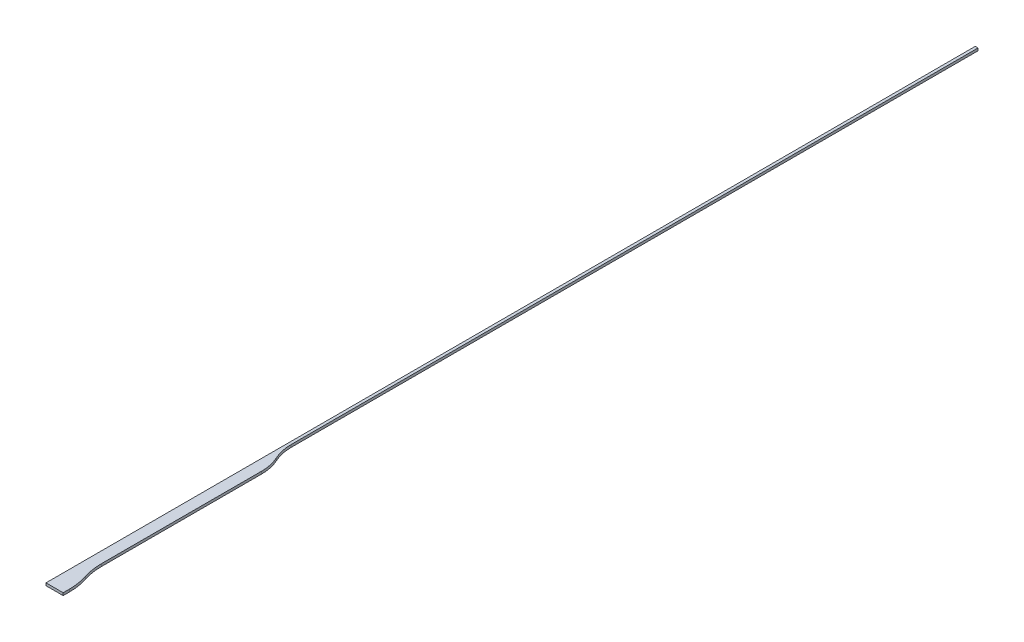
ISO-10303-21;
HEADER;
FILE_DESCRIPTION(('STEP AP214'),'2;1');
FILE_NAME('part.step','',(''),(''),'','','');
FILE_SCHEMA(('AUTOMOTIVE_DESIGN { 1 0 10303 214 1 1 1 1 }'));
ENDSEC;
DATA;
#1=APPLICATION_CONTEXT('core data for automotive mechanical design processes');
#2=APPLICATION_PROTOCOL_DEFINITION('international standard','automotive_design',2000,#1);
#3=PRODUCT_CONTEXT('',#1,'mechanical');
#4=PRODUCT('Part','Part','',(#3));
#5=PRODUCT_RELATED_PRODUCT_CATEGORY('part','',(#4));
#6=PRODUCT_DEFINITION_FORMATION('','',#4);
#7=PRODUCT_DEFINITION_CONTEXT('part definition',#1,'design');
#8=PRODUCT_DEFINITION('design','',#6,#7);
#9=PRODUCT_DEFINITION_SHAPE('','',#8);
#10=(LENGTH_UNIT() NAMED_UNIT(*) SI_UNIT(.MILLI.,.METRE.));
#11=(NAMED_UNIT(*) PLANE_ANGLE_UNIT() SI_UNIT($,.RADIAN.));
#12=(NAMED_UNIT(*) SI_UNIT($,.STERADIAN.) SOLID_ANGLE_UNIT());
#13=UNCERTAINTY_MEASURE_WITH_UNIT(LENGTH_MEASURE(1.E-05),#10,'distance_accuracy_value','');
#14=(GEOMETRIC_REPRESENTATION_CONTEXT(3) GLOBAL_UNCERTAINTY_ASSIGNED_CONTEXT((#13)) GLOBAL_UNIT_ASSIGNED_CONTEXT((#10,
#11,#12)) REPRESENTATION_CONTEXT('',''));
#15=CARTESIAN_POINT('',(0.,0.,0.));
#16=DIRECTION('',(0.,0.,1.));
#17=DIRECTION('',(1.,0.,0.));
#18=AXIS2_PLACEMENT_3D('',#15,#16,#17);
#19=CARTESIAN_POINT('',(-204.,5.,-960.4));
#20=DIRECTION('',(-1.,0.,0.));
#21=DIRECTION('',(0.,0.,1.));
#22=AXIS2_PLACEMENT_3D('',#19,#20,#21);
#23=PLANE('',#22);
#24=DIRECTION('',(0.,0.,-1.));
#25=VECTOR('',#24,1.);
#26=CARTESIAN_POINT('',(-204.,-5.,-960.4));
#27=LINE('',#26,#25);
#28=CARTESIAN_POINT('',(-204.000000000001,-5.,-960.4));
#29=VERTEX_POINT('',#28);
#30=CARTESIAN_POINT('',(-204.,-5.,-3680.99975));
#31=VERTEX_POINT('',#30);
#32=EDGE_CURVE('E137',#29,#31,#27,.T.);
#33=ORIENTED_EDGE('',*,*,#32,.T.);
#34=DIRECTION('',(0.,-1.,0.));
#35=VECTOR('',#34,1.);
#36=CARTESIAN_POINT('',(-204.,5.,-3680.99975));
#37=LINE('',#36,#35);
#38=CARTESIAN_POINT('',(-204.,5.,-3680.99975));
#39=VERTEX_POINT('',#38);
#40=EDGE_CURVE('E11',#39,#31,#37,.T.);
#41=ORIENTED_EDGE('',*,*,#40,.F.);
#42=DIRECTION('',(0.,0.,-1.));
#43=VECTOR('',#42,1.);
#44=CARTESIAN_POINT('',(-204.,5.,-960.4));
#45=LINE('',#44,#43);
#46=CARTESIAN_POINT('',(-204.000000000001,5.,-960.4));
#47=VERTEX_POINT('',#46);
#48=EDGE_CURVE('E92',#47,#39,#45,.T.);
#49=ORIENTED_EDGE('',*,*,#48,.F.);
#50=DIRECTION('',(0.,-1.,0.));
#51=VECTOR('',#50,1.);
#52=CARTESIAN_POINT('',(-204.000000000001,5.,-960.4));
#53=LINE('',#52,#51);
#54=EDGE_CURVE('E133',#47,#29,#53,.T.);
#55=ORIENTED_EDGE('',*,*,#54,.T.);
#56=EDGE_LOOP('',(#33,#41,#49,#55));
#57=FACE_BOUND('',#56,.T.);
#58=ADVANCED_FACE('F32',(#57),#23,.F.);
#59=CARTESIAN_POINT('',(-215.,5.,-3680.99975));
#60=DIRECTION('',(0.,0.,-1.));
#61=DIRECTION('',(-1.,0.,0.));
#62=AXIS2_PLACEMENT_3D('',#59,#60,#61);
#63=PLANE('',#62);
#64=DIRECTION('',(1.,0.,0.));
#65=VECTOR('',#64,1.);
#66=CARTESIAN_POINT('',(-215.,-5.,-3680.99975));
#67=LINE('',#66,#65);
#68=CARTESIAN_POINT('',(-215.,-5.,-3680.99975));
#69=VERTEX_POINT('',#68);
#70=EDGE_CURVE('E140',#69,#31,#67,.T.);
#71=ORIENTED_EDGE('',*,*,#70,.F.);
#72=DIRECTION('',(0.,-1.,0.));
#73=VECTOR('',#72,1.);
#74=CARTESIAN_POINT('',(-215.,5.,-3680.99975));
#75=LINE('',#74,#73);
#76=CARTESIAN_POINT('',(-215.,5.,-3680.99975));
#77=VERTEX_POINT('',#76);
#78=EDGE_CURVE('E40',#77,#69,#75,.T.);
#79=ORIENTED_EDGE('',*,*,#78,.F.);
#80=DIRECTION('',(1.,0.,0.));
#81=VECTOR('',#80,1.);
#82=CARTESIAN_POINT('',(-215.,5.,-3680.99975));
#83=LINE('',#82,#81);
#84=EDGE_CURVE('E195',#77,#39,#83,.T.);
#85=ORIENTED_EDGE('',*,*,#84,.T.);
#86=ORIENTED_EDGE('',*,*,#40,.T.);
#87=EDGE_LOOP('',(#71,#79,#85,#86));
#88=FACE_BOUND('',#87,.T.);
#89=ADVANCED_FACE('F178',(#88),#63,.T.);
#90=CARTESIAN_POINT('',(-215.,5.,-960.4));
#91=DIRECTION('',(-1.,0.,0.));
#92=DIRECTION('',(0.,0.,1.));
#93=AXIS2_PLACEMENT_3D('',#90,#91,#92);
#94=PLANE('',#93);
#95=DIRECTION('',(0.,0.,-1.));
#96=VECTOR('',#95,1.);
#97=CARTESIAN_POINT('',(-215.,-5.,-960.4));
#98=LINE('',#97,#96);
#99=CARTESIAN_POINT('',(-215.,-5.,0.));
#100=VERTEX_POINT('',#99);
#101=EDGE_CURVE('E144',#100,#69,#98,.T.);
#102=ORIENTED_EDGE('',*,*,#101,.F.);
#103=DIRECTION('',(0.,1.,0.));
#104=VECTOR('',#103,1.);
#105=CARTESIAN_POINT('',(-215.,-967.089995790414,0.));
#106=LINE('',#105,#104);
#107=CARTESIAN_POINT('',(-215.,5.,0.));
#108=VERTEX_POINT('',#107);
#109=EDGE_CURVE('E141',#100,#108,#106,.T.);
#110=ORIENTED_EDGE('',*,*,#109,.T.);
#111=DIRECTION('',(0.,0.,-1.));
#112=VECTOR('',#111,1.);
#113=CARTESIAN_POINT('',(-215.,5.,-960.4));
#114=LINE('',#113,#112);
#115=EDGE_CURVE('E175',#108,#77,#114,.T.);
#116=ORIENTED_EDGE('',*,*,#115,.T.);
#117=ORIENTED_EDGE('',*,*,#78,.T.);
#118=EDGE_LOOP('',(#102,#110,#116,#117));
#119=FACE_BOUND('',#118,.T.);
#120=ADVANCED_FACE('F173',(#119),#94,.T.);
#121=CARTESIAN_POINT('',(-147.,5.,0.));
#122=DIRECTION('',(0.,0.,1.));
#123=DIRECTION('',(1.,0.,0.));
#124=AXIS2_PLACEMENT_3D('',#121,#122,#123);
#125=PLANE('',#124);
#126=DIRECTION('',(-1.,0.,0.));
#127=VECTOR('',#126,1.);
#128=CARTESIAN_POINT('',(-147.,-5.,0.));
#129=LINE('',#128,#127);
#130=CARTESIAN_POINT('',(-147.,-5.,0.));
#131=VERTEX_POINT('',#130);
#132=EDGE_CURVE('E147',#131,#100,#129,.T.);
#133=ORIENTED_EDGE('',*,*,#132,.F.);
#134=DIRECTION('',(0.,-1.,0.));
#135=VECTOR('',#134,1.);
#136=CARTESIAN_POINT('',(-147.,5.,0.));
#137=LINE('',#136,#135);
#138=CARTESIAN_POINT('',(-147.,5.,0.));
#139=VERTEX_POINT('',#138);
#140=EDGE_CURVE('E168',#139,#131,#137,.T.);
#141=ORIENTED_EDGE('',*,*,#140,.F.);
#142=DIRECTION('',(-1.,0.,0.));
#143=VECTOR('',#142,1.);
#144=CARTESIAN_POINT('',(-147.,5.,0.));
#145=LINE('',#144,#143);
#146=EDGE_CURVE('E191',#139,#108,#145,.T.);
#147=ORIENTED_EDGE('',*,*,#146,.T.);
#148=ORIENTED_EDGE('',*,*,#109,.F.);
#149=EDGE_LOOP('',(#133,#141,#147,#148));
#150=FACE_BOUND('',#149,.T.);
#151=ADVANCED_FACE('F189',(#150),#125,.T.);
#152=CARTESIAN_POINT('',(-147.,5.,0.));
#153=DIRECTION('',(-1.,0.,0.));
#154=DIRECTION('',(0.,0.,1.));
#155=AXIS2_PLACEMENT_3D('',#152,#153,#154);
#156=PLANE('',#155);
#157=DIRECTION('',(0.,0.,-1.));
#158=VECTOR('',#157,1.);
#159=CARTESIAN_POINT('',(-147.,-5.,0.));
#160=LINE('',#159,#158);
#161=CARTESIAN_POINT('',(-147.,-5.,-25.));
#162=VERTEX_POINT('',#161);
#163=EDGE_CURVE('E150',#131,#162,#160,.T.);
#164=ORIENTED_EDGE('',*,*,#163,.T.);
#165=DIRECTION('',(0.,-1.,0.));
#166=VECTOR('',#165,1.);
#167=CARTESIAN_POINT('',(-147.,5.,-25.));
#168=LINE('',#167,#166);
#169=CARTESIAN_POINT('',(-147.,5.,-25.));
#170=VERTEX_POINT('',#169);
#171=EDGE_CURVE('E165',#170,#162,#168,.T.);
#172=ORIENTED_EDGE('',*,*,#171,.F.);
#173=DIRECTION('',(0.,0.,-1.));
#174=VECTOR('',#173,1.);
#175=CARTESIAN_POINT('',(-147.,5.,0.));
#176=LINE('',#175,#174);
#177=EDGE_CURVE('E199',#139,#170,#176,.T.);
#178=ORIENTED_EDGE('',*,*,#177,.F.);
#179=ORIENTED_EDGE('',*,*,#140,.T.);
#180=EDGE_LOOP('',(#164,#172,#178,#179));
#181=FACE_BOUND('',#180,.T.);
#182=ADVANCED_FACE('F233',(#181),#156,.F.);
#183=CARTESIAN_POINT('',(-387.374999999999,5.,-25.));
#184=DIRECTION('',(0.,-1.,0.));
#185=DIRECTION('',(0.,0.,-1.));
#186=AXIS2_PLACEMENT_3D('',#183,#184,#185);
#187=CYLINDRICAL_SURFACE('',#186,240.374999999999);
#188=CARTESIAN_POINT('',(-387.374999999999,-5.,-25.));
#189=DIRECTION('',(0.,1.,0.));
#190=DIRECTION('',(0.,0.,1.));
#191=AXIS2_PLACEMENT_3D('',#188,#189,#190);
#192=CIRCLE('',#191,240.374999999999);
#193=CARTESIAN_POINT('',(-159.,-5.,-100.));
#194=VERTEX_POINT('',#193);
#195=EDGE_CURVE('E152',#162,#194,#192,.T.);
#196=ORIENTED_EDGE('',*,*,#195,.T.);
#197=DIRECTION('',(0.,-1.,0.));
#198=VECTOR('',#197,1.);
#199=CARTESIAN_POINT('',(-159.,5.,-100.));
#200=LINE('',#199,#198);
#201=CARTESIAN_POINT('',(-159.,5.,-100.));
#202=VERTEX_POINT('',#201);
#203=EDGE_CURVE('E162',#202,#194,#200,.T.);
#204=ORIENTED_EDGE('',*,*,#203,.F.);
#205=CARTESIAN_POINT('',(-387.374999999999,5.,-25.));
#206=DIRECTION('',(0.,1.,0.));
#207=DIRECTION('',(0.,0.,1.));
#208=AXIS2_PLACEMENT_3D('',#205,#206,#207);
#209=CIRCLE('',#208,240.374999999999);
#210=EDGE_CURVE('E201',#170,#202,#209,.T.);
#211=ORIENTED_EDGE('',*,*,#210,.F.);
#212=ORIENTED_EDGE('',*,*,#171,.T.);
#213=EDGE_LOOP('',(#196,#204,#211,#212));
#214=FACE_BOUND('',#213,.T.);
#215=ADVANCED_FACE('F207',(#214),#187,.T.);
#216=CARTESIAN_POINT('',(69.3749999999992,5.,-175.));
#217=DIRECTION('',(0.,-1.,0.));
#218=DIRECTION('',(0.,0.,-1.));
#219=AXIS2_PLACEMENT_3D('',#216,#217,#218);
#220=CYLINDRICAL_SURFACE('',#219,240.374999999999);
#221=CARTESIAN_POINT('',(69.3749999999992,-5.,-175.));
#222=DIRECTION('',(0.,-1.,0.));
#223=DIRECTION('',(0.,0.,1.));
#224=AXIS2_PLACEMENT_3D('',#221,#222,#223);
#225=CIRCLE('',#224,240.374999999999);
#226=CARTESIAN_POINT('',(-171.,-5.,-175.));
#227=VERTEX_POINT('',#226);
#228=EDGE_CURVE('E154',#194,#227,#225,.T.);
#229=ORIENTED_EDGE('',*,*,#228,.T.);
#230=DIRECTION('',(0.,-1.,0.));
#231=VECTOR('',#230,1.);
#232=CARTESIAN_POINT('',(-171.,5.,-175.));
#233=LINE('',#232,#231);
#234=CARTESIAN_POINT('',(-171.,5.,-175.));
#235=VERTEX_POINT('',#234);
#236=EDGE_CURVE('E128',#235,#227,#233,.T.);
#237=ORIENTED_EDGE('',*,*,#236,.F.);
#238=CARTESIAN_POINT('',(69.3749999999992,5.,-175.));
#239=DIRECTION('',(0.,-1.,0.));
#240=DIRECTION('',(0.,0.,1.));
#241=AXIS2_PLACEMENT_3D('',#238,#239,#240);
#242=CIRCLE('',#241,240.374999999999);
#243=EDGE_CURVE('E119',#202,#235,#242,.T.);
#244=ORIENTED_EDGE('',*,*,#243,.F.);
#245=ORIENTED_EDGE('',*,*,#203,.T.);
#246=EDGE_LOOP('',(#229,#237,#244,#245));
#247=FACE_BOUND('',#246,.T.);
#248=ADVANCED_FACE('F210',(#247),#220,.F.);
#249=CARTESIAN_POINT('',(-171.,5.,-175.));
#250=DIRECTION('',(-1.,0.,0.));
#251=DIRECTION('',(0.,0.,1.));
#252=AXIS2_PLACEMENT_3D('',#249,#250,#251);
#253=PLANE('',#252);
#254=DIRECTION('',(0.,0.,-1.));
#255=VECTOR('',#254,1.);
#256=CARTESIAN_POINT('',(-171.,-5.,-175.));
#257=LINE('',#256,#255);
#258=CARTESIAN_POINT('',(-171.,-5.,-810.4));
#259=VERTEX_POINT('',#258);
#260=EDGE_CURVE('E127',#227,#259,#257,.T.);
#261=ORIENTED_EDGE('',*,*,#260,.T.);
#262=DIRECTION('',(0.,-1.,0.));
#263=VECTOR('',#262,1.);
#264=CARTESIAN_POINT('',(-171.,5.,-810.4));
#265=LINE('',#264,#263);
#266=CARTESIAN_POINT('',(-171.,5.,-810.4));
#267=VERTEX_POINT('',#266);
#268=EDGE_CURVE('E124',#267,#259,#265,.T.);
#269=ORIENTED_EDGE('',*,*,#268,.F.);
#270=DIRECTION('',(0.,0.,-1.));
#271=VECTOR('',#270,1.);
#272=CARTESIAN_POINT('',(-171.,5.,-175.));
#273=LINE('',#272,#271);
#274=EDGE_CURVE('E112',#235,#267,#273,.T.);
#275=ORIENTED_EDGE('',*,*,#274,.F.);
#276=ORIENTED_EDGE('',*,*,#236,.T.);
#277=EDGE_LOOP('',(#261,#269,#275,#276));
#278=FACE_BOUND('',#277,.T.);
#279=ADVANCED_FACE('F125',(#278),#253,.F.);
#280=CARTESIAN_POINT('',(-349.70454545453,5.,-810.4));
#281=DIRECTION('',(0.,-1.,0.));
#282=DIRECTION('',(0.,0.,-1.));
#283=AXIS2_PLACEMENT_3D('',#280,#281,#282);
#284=CYLINDRICAL_SURFACE('',#283,178.704545454531);
#285=CARTESIAN_POINT('',(-349.70454545453,-5.,-810.4));
#286=DIRECTION('',(0.,1.,0.));
#287=DIRECTION('',(0.,0.,1.));
#288=AXIS2_PLACEMENT_3D('',#285,#286,#287);
#289=CIRCLE('',#288,178.704545454531);
#290=CARTESIAN_POINT('',(-187.500000000001,-5.,-885.4));
#291=VERTEX_POINT('',#290);
#292=EDGE_CURVE('E80',#259,#291,#289,.T.);
#293=ORIENTED_EDGE('',*,*,#292,.T.);
#294=DIRECTION('',(0.,-1.,0.));
#295=VECTOR('',#294,1.);
#296=CARTESIAN_POINT('',(-187.500000000001,5.,-885.4));
#297=LINE('',#296,#295);
#298=CARTESIAN_POINT('',(-187.500000000001,5.,-885.4));
#299=VERTEX_POINT('',#298);
#300=EDGE_CURVE('E129',#299,#291,#297,.T.);
#301=ORIENTED_EDGE('',*,*,#300,.F.);
#302=CARTESIAN_POINT('',(-349.70454545453,5.,-810.4));
#303=DIRECTION('',(0.,1.,0.));
#304=DIRECTION('',(0.,0.,1.));
#305=AXIS2_PLACEMENT_3D('',#302,#303,#304);
#306=CIRCLE('',#305,178.704545454531);
#307=EDGE_CURVE('E117',#267,#299,#306,.T.);
#308=ORIENTED_EDGE('',*,*,#307,.F.);
#309=ORIENTED_EDGE('',*,*,#268,.T.);
#310=EDGE_LOOP('',(#293,#301,#308,#309));
#311=FACE_BOUND('',#310,.T.);
#312=ADVANCED_FACE('F131',(#311),#284,.T.);
#313=CARTESIAN_POINT('',(-25.2954545454701,5.,-960.4));
#314=DIRECTION('',(0.,-1.,0.));
#315=DIRECTION('',(0.,0.,-1.));
#316=AXIS2_PLACEMENT_3D('',#313,#314,#315);
#317=CYLINDRICAL_SURFACE('',#316,178.704545454531);
#318=CARTESIAN_POINT('',(-25.2954545454701,-5.,-960.4));
#319=DIRECTION('',(0.,-1.,0.));
#320=DIRECTION('',(0.,0.,1.));
#321=AXIS2_PLACEMENT_3D('',#318,#319,#320);
#322=CIRCLE('',#321,178.704545454531);
#323=EDGE_CURVE('E86',#291,#29,#322,.T.);
#324=ORIENTED_EDGE('',*,*,#323,.T.);
#325=ORIENTED_EDGE('',*,*,#54,.F.);
#326=CARTESIAN_POINT('',(-25.2954545454701,5.,-960.4));
#327=DIRECTION('',(0.,-1.,0.));
#328=DIRECTION('',(0.,0.,1.));
#329=AXIS2_PLACEMENT_3D('',#326,#327,#328);
#330=CIRCLE('',#329,178.704545454531);
#331=EDGE_CURVE('E48',#299,#47,#330,.T.);
#332=ORIENTED_EDGE('',*,*,#331,.F.);
#333=ORIENTED_EDGE('',*,*,#300,.T.);
#334=EDGE_LOOP('',(#324,#325,#332,#333));
#335=FACE_BOUND('',#334,.T.);
#336=ADVANCED_FACE('F212',(#335),#317,.F.);
#337=CARTESIAN_POINT('',(-25.2954545454701,5.,-960.4));
#338=DIRECTION('',(0.,1.,0.));
#339=DIRECTION('',(0.,0.,1.));
#340=AXIS2_PLACEMENT_3D('',#337,#338,#339);
#341=PLANE('',#340);
#342=ORIENTED_EDGE('',*,*,#115,.F.);
#343=ORIENTED_EDGE('',*,*,#146,.F.);
#344=ORIENTED_EDGE('',*,*,#177,.T.);
#345=ORIENTED_EDGE('',*,*,#210,.T.);
#346=ORIENTED_EDGE('',*,*,#243,.T.);
#347=ORIENTED_EDGE('',*,*,#274,.T.);
#348=ORIENTED_EDGE('',*,*,#307,.T.);
#349=ORIENTED_EDGE('',*,*,#331,.T.);
#350=ORIENTED_EDGE('',*,*,#48,.T.);
#351=ORIENTED_EDGE('',*,*,#84,.F.);
#352=EDGE_LOOP('',(#342,#343,#344,#345,#346,#347,#348,#349,#350,#351));
#353=FACE_BOUND('',#352,.T.);
#354=ADVANCED_FACE('F115',(#353),#341,.T.);
#355=CARTESIAN_POINT('',(-25.2954545454701,-5.,-960.4));
#356=DIRECTION('',(0.,1.,0.));
#357=DIRECTION('',(0.,0.,1.));
#358=AXIS2_PLACEMENT_3D('',#355,#356,#357);
#359=PLANE('',#358);
#360=ORIENTED_EDGE('',*,*,#132,.T.);
#361=ORIENTED_EDGE('',*,*,#101,.T.);
#362=ORIENTED_EDGE('',*,*,#70,.T.);
#363=ORIENTED_EDGE('',*,*,#32,.F.);
#364=ORIENTED_EDGE('',*,*,#323,.F.);
#365=ORIENTED_EDGE('',*,*,#292,.F.);
#366=ORIENTED_EDGE('',*,*,#260,.F.);
#367=ORIENTED_EDGE('',*,*,#228,.F.);
#368=ORIENTED_EDGE('',*,*,#195,.F.);
#369=ORIENTED_EDGE('',*,*,#163,.F.);
#370=EDGE_LOOP('',(#360,#361,#362,#363,#364,#365,#366,#367,#368,#369));
#371=FACE_BOUND('',#370,.T.);
#372=ADVANCED_FACE('F181',(#371),#359,.F.);
#373=CLOSED_SHELL('',(#58,#89,#120,#151,#182,#215,#248,#279,#312,#336,#354,#372));
#374=MANIFOLD_SOLID_BREP('B2',#373);
#375=ADVANCED_BREP_SHAPE_REPRESENTATION('',(#18,#374),#14);
#376=SHAPE_DEFINITION_REPRESENTATION(#9,#375);
ENDSEC;
END-ISO-10303-21;
